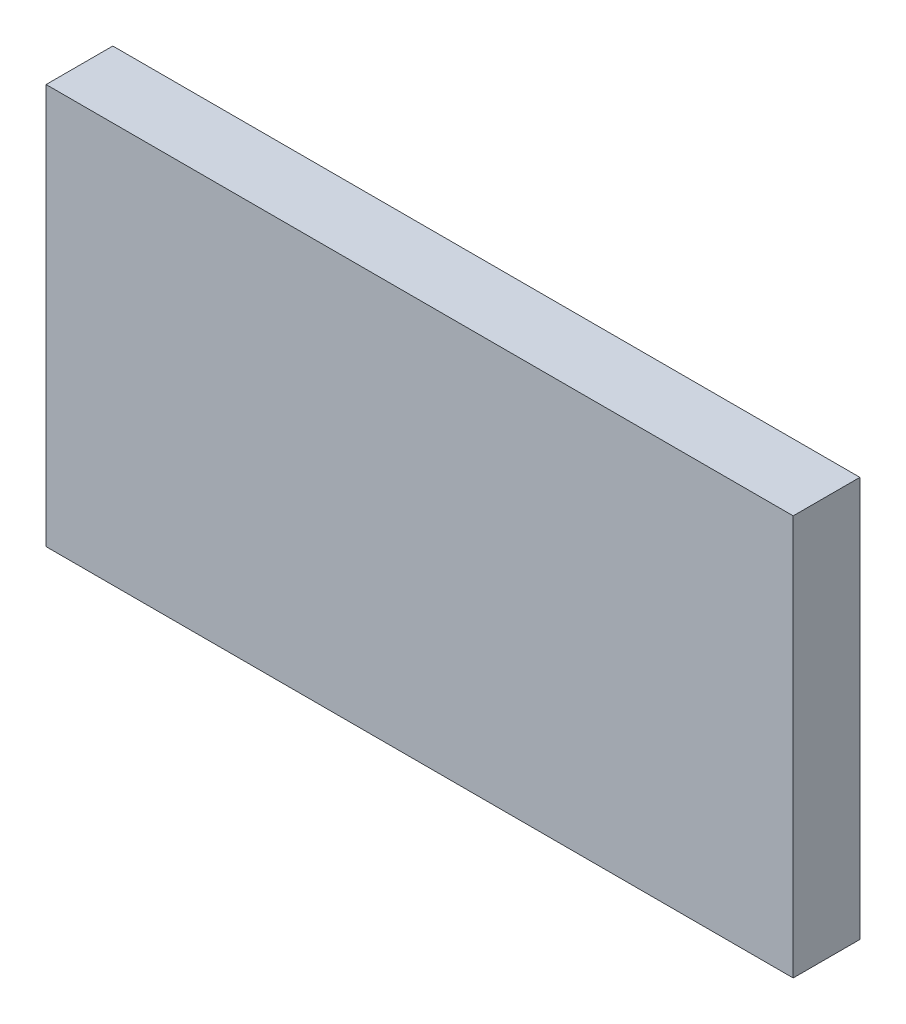
ISO-10303-21;
HEADER;
FILE_DESCRIPTION(('STEP AP214'),'2;1');
FILE_NAME('part.step','',(''),(''),'','','');
FILE_SCHEMA(('AUTOMOTIVE_DESIGN { 1 0 10303 214 1 1 1 1 }'));
ENDSEC;
DATA;
#1=APPLICATION_CONTEXT('core data for automotive mechanical design processes');
#2=APPLICATION_PROTOCOL_DEFINITION('international standard','automotive_design',2000,#1);
#3=PRODUCT_CONTEXT('',#1,'mechanical');
#4=PRODUCT('Part','Part','',(#3));
#5=PRODUCT_RELATED_PRODUCT_CATEGORY('part','',(#4));
#6=PRODUCT_DEFINITION_FORMATION('','',#4);
#7=PRODUCT_DEFINITION_CONTEXT('part definition',#1,'design');
#8=PRODUCT_DEFINITION('design','',#6,#7);
#9=PRODUCT_DEFINITION_SHAPE('','',#8);
#10=(LENGTH_UNIT() NAMED_UNIT(*) SI_UNIT(.MILLI.,.METRE.));
#11=(NAMED_UNIT(*) PLANE_ANGLE_UNIT() SI_UNIT($,.RADIAN.));
#12=(NAMED_UNIT(*) SI_UNIT($,.STERADIAN.) SOLID_ANGLE_UNIT());
#13=UNCERTAINTY_MEASURE_WITH_UNIT(LENGTH_MEASURE(1.E-05),#10,'distance_accuracy_value','');
#14=(GEOMETRIC_REPRESENTATION_CONTEXT(3) GLOBAL_UNCERTAINTY_ASSIGNED_CONTEXT((#13)) GLOBAL_UNIT_ASSIGNED_CONTEXT((#10,
#11,#12)) REPRESENTATION_CONTEXT('',''));
#15=CARTESIAN_POINT('',(0.,0.,0.));
#16=DIRECTION('',(0.,0.,1.));
#17=DIRECTION('',(1.,0.,0.));
#18=AXIS2_PLACEMENT_3D('',#15,#16,#17);
#19=CARTESIAN_POINT('',(0.182515457347921,-0.738316509343394,0.0826433070866142));
#20=DIRECTION('',(0.,0.,1.));
#21=DIRECTION('',(0.,-1.,0.));
#22=AXIS2_PLACEMENT_3D('',#19,#20,#21);
#23=PLANE('',#22);
#24=DIRECTION('',(0.,1.,0.));
#25=VECTOR('',#24,1.);
#26=CARTESIAN_POINT('',(0.108436717190441,-0.738316509343394,0.0826433070866142));
#27=LINE('',#26,#25);
#28=CARTESIAN_POINT('',(0.108436717190441,-0.736426745563867,0.0826433070866142));
#29=VERTEX_POINT('',#28);
#30=CARTESIAN_POINT('',(0.108436717190441,-0.698631469973316,0.0826433070866142));
#31=VERTEX_POINT('',#30);
#32=EDGE_CURVE('E71',#29,#31,#27,.T.);
#33=ORIENTED_EDGE('',*,*,#32,.T.);
#34=DIRECTION('',(1.,0.,0.));
#35=VECTOR('',#34,1.);
#36=CARTESIAN_POINT('',(0.182515457347921,-0.698631469973316,0.0826433070866142));
#37=LINE('',#36,#35);
#38=CARTESIAN_POINT('',(0.178987898292803,-0.698631469973316,0.0826433070866142));
#39=VERTEX_POINT('',#38);
#40=EDGE_CURVE('E54',#39,#31,#37,.F.);
#41=ORIENTED_EDGE('',*,*,#40,.F.);
#42=DIRECTION('',(0.,1.,0.));
#43=VECTOR('',#42,1.);
#44=CARTESIAN_POINT('',(0.178987898292803,-0.738316509343394,0.0826433070866142));
#45=LINE('',#44,#43);
#46=CARTESIAN_POINT('',(0.178987898292803,-0.736426745563867,0.0826433070866142));
#47=VERTEX_POINT('',#46);
#48=EDGE_CURVE('E20',#47,#39,#45,.T.);
#49=ORIENTED_EDGE('',*,*,#48,.F.);
#50=DIRECTION('',(1.,0.,0.));
#51=VECTOR('',#50,1.);
#52=CARTESIAN_POINT('',(0.104909158135323,-0.736426745563867,0.0826433070866142));
#53=LINE('',#52,#51);
#54=EDGE_CURVE('E81',#29,#47,#53,.T.);
#55=ORIENTED_EDGE('',*,*,#54,.F.);
#56=EDGE_LOOP('',(#33,#41,#49,#55));
#57=FACE_BOUND('',#56,.T.);
#58=ADVANCED_FACE('F17',(#57),#23,.F.);
#59=CARTESIAN_POINT('',(0.178987898292803,-0.738316509343394,0.0823283464566929));
#60=DIRECTION('',(-1.,0.,0.));
#61=DIRECTION('',(0.,0.,1.));
#62=AXIS2_PLACEMENT_3D('',#59,#60,#61);
#63=PLANE('',#62);
#64=DIRECTION('',(0.,0.,1.));
#65=VECTOR('',#64,1.);
#66=CARTESIAN_POINT('',(0.178987898292803,-0.736426745563867,0.0823283464566929));
#67=LINE('',#66,#65);
#68=CARTESIAN_POINT('',(0.178987898292803,-0.736426745563867,0.0889425196850394));
#69=VERTEX_POINT('',#68);
#70=EDGE_CURVE('E64',#47,#69,#67,.T.);
#71=ORIENTED_EDGE('',*,*,#70,.F.);
#72=ORIENTED_EDGE('',*,*,#48,.T.);
#73=DIRECTION('',(0.,0.,-1.));
#74=VECTOR('',#73,1.);
#75=CARTESIAN_POINT('',(0.178987898292803,-0.698631469973316,0.0823283464566929));
#76=LINE('',#75,#74);
#77=CARTESIAN_POINT('',(0.178987898292803,-0.698631469973316,0.0889425196850394));
#78=VERTEX_POINT('',#77);
#79=EDGE_CURVE('E62',#78,#39,#76,.T.);
#80=ORIENTED_EDGE('',*,*,#79,.F.);
#81=DIRECTION('',(0.,1.,0.));
#82=VECTOR('',#81,1.);
#83=CARTESIAN_POINT('',(0.178987898292803,-0.738316509343394,0.0889425196850394));
#84=LINE('',#83,#82);
#85=EDGE_CURVE('E83',#69,#78,#84,.T.);
#86=ORIENTED_EDGE('',*,*,#85,.F.);
#87=EDGE_LOOP('',(#71,#72,#80,#86));
#88=FACE_BOUND('',#87,.T.);
#89=ADVANCED_FACE('F60',(#88),#63,.F.);
#90=CARTESIAN_POINT('',(0.182515457347921,-0.698631469973316,0.0823283464566929));
#91=DIRECTION('',(0.,-1.,0.));
#92=DIRECTION('',(0.,0.,-1.));
#93=AXIS2_PLACEMENT_3D('',#90,#91,#92);
#94=PLANE('',#93);
#95=DIRECTION('',(0.,0.,1.));
#96=VECTOR('',#95,1.);
#97=CARTESIAN_POINT('',(0.108436717190441,-0.698631469973316,0.0823283464566929));
#98=LINE('',#97,#96);
#99=CARTESIAN_POINT('',(0.108436717190441,-0.698631469973316,0.0889425196850394));
#100=VERTEX_POINT('',#99);
#101=EDGE_CURVE('E73',#31,#100,#98,.T.);
#102=ORIENTED_EDGE('',*,*,#101,.T.);
#103=DIRECTION('',(1.,0.,0.));
#104=VECTOR('',#103,1.);
#105=CARTESIAN_POINT('',(0.182515457347921,-0.698631469973316,0.0889425196850394));
#106=LINE('',#105,#104);
#107=EDGE_CURVE('E69',#78,#100,#106,.F.);
#108=ORIENTED_EDGE('',*,*,#107,.F.);
#109=ORIENTED_EDGE('',*,*,#79,.T.);
#110=ORIENTED_EDGE('',*,*,#40,.T.);
#111=EDGE_LOOP('',(#102,#108,#109,#110));
#112=FACE_BOUND('',#111,.T.);
#113=ADVANCED_FACE('F68',(#112),#94,.F.);
#114=CARTESIAN_POINT('',(0.108436717190441,-0.738316509343394,0.0823283464566929));
#115=DIRECTION('',(-1.,0.,0.));
#116=DIRECTION('',(0.,0.,1.));
#117=AXIS2_PLACEMENT_3D('',#114,#115,#116);
#118=PLANE('',#117);
#119=ORIENTED_EDGE('',*,*,#32,.F.);
#120=DIRECTION('',(0.,0.,1.));
#121=VECTOR('',#120,1.);
#122=CARTESIAN_POINT('',(0.108436717190441,-0.736426745563867,0.0823283464566929));
#123=LINE('',#122,#121);
#124=CARTESIAN_POINT('',(0.108436717190441,-0.736426745563867,0.0889425196850394));
#125=VERTEX_POINT('',#124);
#126=EDGE_CURVE('E78',#125,#29,#123,.F.);
#127=ORIENTED_EDGE('',*,*,#126,.F.);
#128=DIRECTION('',(0.,1.,0.));
#129=VECTOR('',#128,1.);
#130=CARTESIAN_POINT('',(0.108436717190441,-0.738316509343394,0.0889425196850394));
#131=LINE('',#130,#129);
#132=EDGE_CURVE('E26',#100,#125,#131,.F.);
#133=ORIENTED_EDGE('',*,*,#132,.F.);
#134=ORIENTED_EDGE('',*,*,#101,.F.);
#135=EDGE_LOOP('',(#119,#127,#133,#134));
#136=FACE_BOUND('',#135,.T.);
#137=ADVANCED_FACE('F88',(#136),#118,.T.);
#138=CARTESIAN_POINT('',(0.104909158135323,-0.736426745563867,0.0823283464566929));
#139=DIRECTION('',(0.,1.,0.));
#140=DIRECTION('',(0.,0.,1.));
#141=AXIS2_PLACEMENT_3D('',#138,#139,#140);
#142=PLANE('',#141);
#143=ORIENTED_EDGE('',*,*,#126,.T.);
#144=ORIENTED_EDGE('',*,*,#54,.T.);
#145=ORIENTED_EDGE('',*,*,#70,.T.);
#146=DIRECTION('',(1.,0.,0.));
#147=VECTOR('',#146,1.);
#148=CARTESIAN_POINT('',(0.182515457347921,-0.736426745563867,0.0889425196850394));
#149=LINE('',#148,#147);
#150=EDGE_CURVE('E11',#125,#69,#149,.T.);
#151=ORIENTED_EDGE('',*,*,#150,.F.);
#152=EDGE_LOOP('',(#143,#144,#145,#151));
#153=FACE_BOUND('',#152,.T.);
#154=ADVANCED_FACE('F91',(#153),#142,.F.);
#155=CARTESIAN_POINT('',(0.182515457347921,-0.738316509343394,0.0889425196850394));
#156=DIRECTION('',(0.,0.,-1.));
#157=DIRECTION('',(0.,1.,0.));
#158=AXIS2_PLACEMENT_3D('',#155,#156,#157);
#159=PLANE('',#158);
#160=ORIENTED_EDGE('',*,*,#132,.T.);
#161=ORIENTED_EDGE('',*,*,#150,.T.);
#162=ORIENTED_EDGE('',*,*,#85,.T.);
#163=ORIENTED_EDGE('',*,*,#107,.T.);
#164=EDGE_LOOP('',(#160,#161,#162,#163));
#165=FACE_BOUND('',#164,.T.);
#166=ADVANCED_FACE('F86',(#165),#159,.F.);
#167=CLOSED_SHELL('',(#58,#89,#113,#137,#154,#166));
#168=MANIFOLD_SOLID_BREP('B1',#167);
#169=ADVANCED_BREP_SHAPE_REPRESENTATION('',(#18,#168),#14);
#170=SHAPE_DEFINITION_REPRESENTATION(#9,#169);
ENDSEC;
END-ISO-10303-21;
